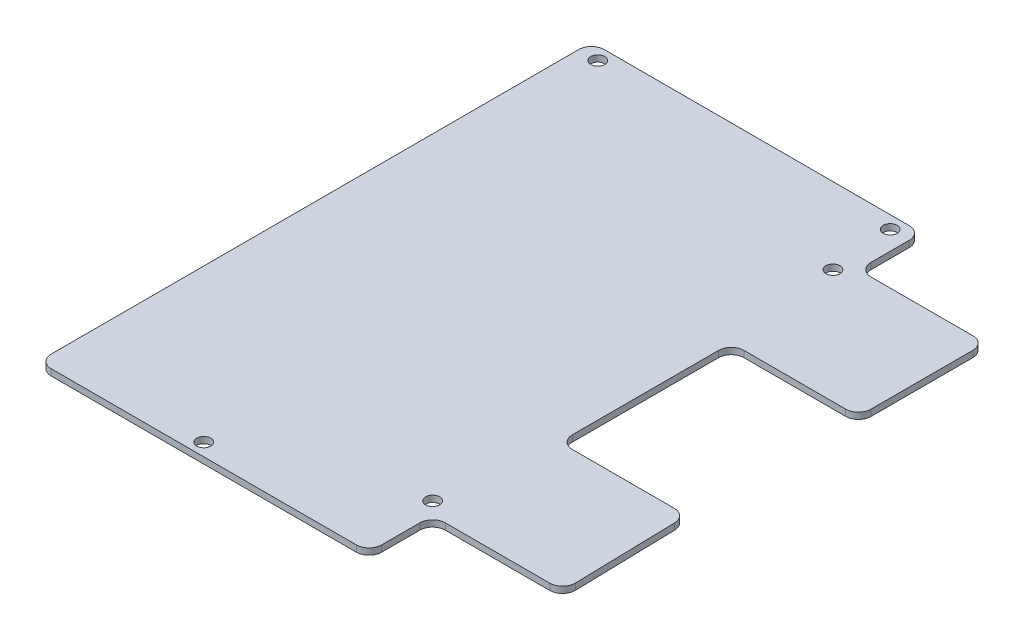
ISO-10303-21;
HEADER;
FILE_DESCRIPTION(('STEP AP214'),'2;1');
FILE_NAME('part.step','',(''),(''),'','','');
FILE_SCHEMA(('AUTOMOTIVE_DESIGN { 1 0 10303 214 1 1 1 1 }'));
ENDSEC;
DATA;
#1=APPLICATION_CONTEXT('core data for automotive mechanical design processes');
#2=APPLICATION_PROTOCOL_DEFINITION('international standard','automotive_design',2000,#1);
#3=PRODUCT_CONTEXT('',#1,'mechanical');
#4=PRODUCT('Part','Part','',(#3));
#5=PRODUCT_RELATED_PRODUCT_CATEGORY('part','',(#4));
#6=PRODUCT_DEFINITION_FORMATION('','',#4);
#7=PRODUCT_DEFINITION_CONTEXT('part definition',#1,'design');
#8=PRODUCT_DEFINITION('design','',#6,#7);
#9=PRODUCT_DEFINITION_SHAPE('','',#8);
#10=(LENGTH_UNIT() NAMED_UNIT(*) SI_UNIT(.MILLI.,.METRE.));
#11=(NAMED_UNIT(*) PLANE_ANGLE_UNIT() SI_UNIT($,.RADIAN.));
#12=(NAMED_UNIT(*) SI_UNIT($,.STERADIAN.) SOLID_ANGLE_UNIT());
#13=UNCERTAINTY_MEASURE_WITH_UNIT(LENGTH_MEASURE(1.E-05),#10,'distance_accuracy_value','');
#14=(GEOMETRIC_REPRESENTATION_CONTEXT(3) GLOBAL_UNCERTAINTY_ASSIGNED_CONTEXT((#13)) GLOBAL_UNIT_ASSIGNED_CONTEXT((#10,
#11,#12)) REPRESENTATION_CONTEXT('',''));
#15=CARTESIAN_POINT('',(0.,0.,0.));
#16=DIRECTION('',(0.,0.,1.));
#17=DIRECTION('',(1.,0.,0.));
#18=AXIS2_PLACEMENT_3D('',#15,#16,#17);
#19=CARTESIAN_POINT('',(-0.33632682595764,1.,0.));
#20=DIRECTION('',(1.,0.,0.));
#21=DIRECTION('',(0.,0.,-1.));
#22=AXIS2_PLACEMENT_3D('',#19,#20,#21);
#23=PLANE('',#22);
#24=DIRECTION('',(0.,0.,1.));
#25=VECTOR('',#24,1.);
#26=CARTESIAN_POINT('',(-0.33632682595764,1.,0.));
#27=LINE('',#26,#25);
#28=CARTESIAN_POINT('',(-0.33632682595764,1.,-85.));
#29=VERTEX_POINT('',#28);
#30=CARTESIAN_POINT('',(-0.33632682595764,1.,-2.));
#31=VERTEX_POINT('',#30);
#32=EDGE_CURVE('E222',#29,#31,#27,.T.);
#33=ORIENTED_EDGE('',*,*,#32,.F.);
#34=DIRECTION('',(0.,-1.,0.));
#35=VECTOR('',#34,1.);
#36=CARTESIAN_POINT('',(-0.33632682595764,1.,-85.));
#37=LINE('',#36,#35);
#38=CARTESIAN_POINT('',(-0.33632682595764,0.,-85.));
#39=VERTEX_POINT('',#38);
#40=EDGE_CURVE('E206',#29,#39,#37,.T.);
#41=ORIENTED_EDGE('',*,*,#40,.T.);
#42=DIRECTION('',(0.,0.,1.));
#43=VECTOR('',#42,1.);
#44=CARTESIAN_POINT('',(-0.33632682595764,0.,0.));
#45=LINE('',#44,#43);
#46=CARTESIAN_POINT('',(-0.33632682595764,0.,-2.));
#47=VERTEX_POINT('',#46);
#48=EDGE_CURVE('E219',#39,#47,#45,.T.);
#49=ORIENTED_EDGE('',*,*,#48,.T.);
#50=DIRECTION('',(0.,-1.,0.));
#51=VECTOR('',#50,1.);
#52=CARTESIAN_POINT('',(-0.33632682595764,1.,-2.));
#53=LINE('',#52,#51);
#54=EDGE_CURVE('E225',#47,#31,#53,.F.);
#55=ORIENTED_EDGE('',*,*,#54,.T.);
#56=EDGE_LOOP('',(#33,#41,#49,#55));
#57=FACE_BOUND('',#56,.T.);
#58=ADVANCED_FACE('F39',(#57),#23,.F.);
#59=CARTESIAN_POINT('',(-0.33632682595764,1.,0.));
#60=DIRECTION('',(0.,0.,-1.));
#61=DIRECTION('',(-1.,0.,0.));
#62=AXIS2_PLACEMENT_3D('',#59,#60,#61);
#63=PLANE('',#62);
#64=DIRECTION('',(1.,0.,0.));
#65=VECTOR('',#64,1.);
#66=CARTESIAN_POINT('',(-0.33632682595764,0.,0.));
#67=LINE('',#66,#65);
#68=CARTESIAN_POINT('',(1.66367317404236,0.,0.));
#69=VERTEX_POINT('',#68);
#70=CARTESIAN_POINT('',(49.6636731740423,0.,0.));
#71=VERTEX_POINT('',#70);
#72=EDGE_CURVE('E230',#69,#71,#67,.T.);
#73=ORIENTED_EDGE('',*,*,#72,.T.);
#74=DIRECTION('',(0.,-1.,0.));
#75=VECTOR('',#74,1.);
#76=CARTESIAN_POINT('',(49.6636731740424,1.,0.));
#77=LINE('',#76,#75);
#78=CARTESIAN_POINT('',(49.6636731740423,1.,0.));
#79=VERTEX_POINT('',#78);
#80=EDGE_CURVE('E398',#71,#79,#77,.F.);
#81=ORIENTED_EDGE('',*,*,#80,.T.);
#82=DIRECTION('',(1.,0.,0.));
#83=VECTOR('',#82,1.);
#84=CARTESIAN_POINT('',(-0.33632682595764,1.,0.));
#85=LINE('',#84,#83);
#86=CARTESIAN_POINT('',(1.66367317404236,1.,0.));
#87=VERTEX_POINT('',#86);
#88=EDGE_CURVE('E448',#87,#79,#85,.T.);
#89=ORIENTED_EDGE('',*,*,#88,.F.);
#90=DIRECTION('',(0.,-1.,0.));
#91=VECTOR('',#90,1.);
#92=CARTESIAN_POINT('',(1.66367317404236,1.,0.));
#93=LINE('',#92,#91);
#94=EDGE_CURVE('E394',#87,#69,#93,.T.);
#95=ORIENTED_EDGE('',*,*,#94,.T.);
#96=EDGE_LOOP('',(#73,#81,#89,#95));
#97=FACE_BOUND('',#96,.T.);
#98=ADVANCED_FACE('F547',(#97),#63,.F.);
#99=CARTESIAN_POINT('',(51.6636731740424,1.,0.));
#100=DIRECTION('',(-1.,0.,0.));
#101=DIRECTION('',(0.,0.,1.));
#102=AXIS2_PLACEMENT_3D('',#99,#100,#101);
#103=PLANE('',#102);
#104=DIRECTION('',(0.,0.,-1.));
#105=VECTOR('',#104,1.);
#106=CARTESIAN_POINT('',(51.6636731740424,0.,0.));
#107=LINE('',#106,#105);
#108=CARTESIAN_POINT('',(51.6636731740424,0.,-2.));
#109=VERTEX_POINT('',#108);
#110=CARTESIAN_POINT('',(51.6636731740424,0.,-8.00287687778543));
#111=VERTEX_POINT('',#110);
#112=EDGE_CURVE('E236',#109,#111,#107,.T.);
#113=ORIENTED_EDGE('',*,*,#112,.T.);
#114=DIRECTION('',(0.,-1.,0.));
#115=VECTOR('',#114,1.);
#116=CARTESIAN_POINT('',(51.6636731740424,1.,-8.00287687778543));
#117=LINE('',#116,#115);
#118=CARTESIAN_POINT('',(51.6636731740424,1.,-8.00287687778543));
#119=VERTEX_POINT('',#118);
#120=EDGE_CURVE('E391',#111,#119,#117,.F.);
#121=ORIENTED_EDGE('',*,*,#120,.T.);
#122=DIRECTION('',(0.,0.,-1.));
#123=VECTOR('',#122,1.);
#124=CARTESIAN_POINT('',(51.6636731740424,1.,0.));
#125=LINE('',#124,#123);
#126=CARTESIAN_POINT('',(51.6636731740424,1.,-2.));
#127=VERTEX_POINT('',#126);
#128=EDGE_CURVE('E436',#127,#119,#125,.T.);
#129=ORIENTED_EDGE('',*,*,#128,.F.);
#130=DIRECTION('',(0.,-1.,0.));
#131=VECTOR('',#130,1.);
#132=CARTESIAN_POINT('',(51.6636731740424,1.,-2.));
#133=LINE('',#132,#131);
#134=EDGE_CURVE('E387',#127,#109,#133,.T.);
#135=ORIENTED_EDGE('',*,*,#134,.T.);
#136=EDGE_LOOP('',(#113,#121,#129,#135));
#137=FACE_BOUND('',#136,.T.);
#138=ADVANCED_FACE('F424',(#137),#103,.F.);
#139=CARTESIAN_POINT('',(51.6636731740424,1.,-10.0027590485584));
#140=DIRECTION('',(-5.8916348957392E-05,0.,-0.999999998264432));
#141=DIRECTION('',(-0.999999998264432,0.,5.8916348957392E-05));
#142=AXIS2_PLACEMENT_3D('',#139,#140,#141);
#143=PLANE('',#142);
#144=DIRECTION('',(0.999999998264432,0.,-5.8916348957392E-05));
#145=VECTOR('',#144,1.);
#146=CARTESIAN_POINT('',(51.6636731740424,0.,-10.0027590485584));
#147=LINE('',#146,#145);
#148=CARTESIAN_POINT('',(53.6635553413444,0.,-10.0028768743143));
#149=VERTEX_POINT('',#148);
#150=CARTESIAN_POINT('',(70.1040441710044,0.,-10.0038454878929));
#151=VERTEX_POINT('',#150);
#152=EDGE_CURVE('E248',#149,#151,#147,.T.);
#153=ORIENTED_EDGE('',*,*,#152,.T.);
#154=DIRECTION('',(0.,-1.,0.));
#155=VECTOR('',#154,1.);
#156=CARTESIAN_POINT('',(70.1040441710044,1.,-10.0038454878929));
#157=LINE('',#156,#155);
#158=CARTESIAN_POINT('',(70.1040441710044,1.,-10.0038454878929));
#159=VERTEX_POINT('',#158);
#160=EDGE_CURVE('E384',#151,#159,#157,.F.);
#161=ORIENTED_EDGE('',*,*,#160,.T.);
#162=DIRECTION('',(0.999999998264432,0.,-5.8916348957392E-05));
#163=VECTOR('',#162,1.);
#164=CARTESIAN_POINT('',(51.6636731740424,1.,-10.0027590485584));
#165=LINE('',#164,#163);
#166=CARTESIAN_POINT('',(53.6635553413444,1.,-10.0028768743143));
#167=VERTEX_POINT('',#166);
#168=EDGE_CURVE('E434',#167,#159,#165,.T.);
#169=ORIENTED_EDGE('',*,*,#168,.F.);
#170=DIRECTION('',(0.,-1.,0.));
#171=VECTOR('',#170,1.);
#172=CARTESIAN_POINT('',(53.6635553413444,0.,-10.0028768743143));
#173=LINE('',#172,#171);
#174=EDGE_CURVE('E380',#167,#149,#173,.T.);
#175=ORIENTED_EDGE('',*,*,#174,.T.);
#176=EDGE_LOOP('',(#153,#161,#169,#175));
#177=FACE_BOUND('',#176,.T.);
#178=ADVANCED_FACE('F438',(#177),#143,.F.);
#179=CARTESIAN_POINT('',(72.1535232501436,1.,-10.0039662357177));
#180=DIRECTION('',(-0.999700013506133,0.,0.0244925089739334));
#181=DIRECTION('',(0.0244925089739334,0.,0.999700013506133));
#182=AXIS2_PLACEMENT_3D('',#179,#180,#181);
#183=PLANE('',#182);
#184=DIRECTION('',(-0.0244925089739334,0.,-0.999700013506133));
#185=VECTOR('',#184,1.);
#186=CARTESIAN_POINT('',(72.1535232501436,0.,-10.0039662357177));
#187=LINE('',#186,#185);
#188=CARTESIAN_POINT('',(72.1033263653187,0.,-12.0528305023696));
#189=VERTEX_POINT('',#188);
#190=CARTESIAN_POINT('',(71.7114678006262,0.,-28.0471499423502));
#191=VERTEX_POINT('',#190);
#192=EDGE_CURVE('E252',#189,#191,#187,.T.);
#193=ORIENTED_EDGE('',*,*,#192,.T.);
#194=DIRECTION('',(0.,-1.,0.));
#195=VECTOR('',#194,1.);
#196=CARTESIAN_POINT('',(71.7114678006262,1.,-28.0471499423502));
#197=LINE('',#196,#195);
#198=CARTESIAN_POINT('',(71.7114678006262,1.,-28.0471499423502));
#199=VERTEX_POINT('',#198);
#200=EDGE_CURVE('E377',#191,#199,#197,.F.);
#201=ORIENTED_EDGE('',*,*,#200,.T.);
#202=DIRECTION('',(-0.0244925089739334,0.,-0.999700013506133));
#203=VECTOR('',#202,1.);
#204=CARTESIAN_POINT('',(72.1535232501436,1.,-10.0039662357177));
#205=LINE('',#204,#203);
#206=CARTESIAN_POINT('',(72.1033263653187,1.,-12.0528305023696));
#207=VERTEX_POINT('',#206);
#208=EDGE_CURVE('E441',#207,#199,#205,.T.);
#209=ORIENTED_EDGE('',*,*,#208,.F.);
#210=DIRECTION('',(0.,-1.,0.));
#211=VECTOR('',#210,1.);
#212=CARTESIAN_POINT('',(72.1033263653187,1.,-12.0528305023696));
#213=LINE('',#212,#211);
#214=EDGE_CURVE('E373',#207,#189,#213,.T.);
#215=ORIENTED_EDGE('',*,*,#214,.T.);
#216=EDGE_LOOP('',(#193,#201,#209,#215));
#217=FACE_BOUND('',#216,.T.);
#218=ADVANCED_FACE('F532',(#217),#183,.F.);
#219=CARTESIAN_POINT('',(51.6636731740424,1.,-30.));
#220=DIRECTION('',(-0.000101674707981766,0.,0.999999994831127));
#221=DIRECTION('',(0.999999994831127,0.,0.000101674707981766));
#222=AXIS2_PLACEMENT_3D('',#219,#220,#221);
#223=PLANE('',#222);
#224=DIRECTION('',(-0.999999994831127,0.,-0.000101674707981766));
#225=VECTOR('',#224,1.);
#226=CARTESIAN_POINT('',(51.6636731740424,0.,-30.));
#227=LINE('',#226,#225);
#228=CARTESIAN_POINT('',(69.7122711230298,0.,-29.9981649140646));
#229=VERTEX_POINT('',#228);
#230=CARTESIAN_POINT('',(53.6634698246264,0.,-29.9997966712585));
#231=VERTEX_POINT('',#230);
#232=EDGE_CURVE('E256',#229,#231,#227,.T.);
#233=ORIENTED_EDGE('',*,*,#232,.T.);
#234=DIRECTION('',(0.,-1.,0.));
#235=VECTOR('',#234,1.);
#236=CARTESIAN_POINT('',(53.6634698246264,1.,-29.9997966712585));
#237=LINE('',#236,#235);
#238=CARTESIAN_POINT('',(53.6634698246264,1.,-29.9997966712585));
#239=VERTEX_POINT('',#238);
#240=EDGE_CURVE('E370',#231,#239,#237,.F.);
#241=ORIENTED_EDGE('',*,*,#240,.T.);
#242=DIRECTION('',(-0.999999994831127,0.,-0.000101674707981766));
#243=VECTOR('',#242,1.);
#244=CARTESIAN_POINT('',(51.6636731740424,1.,-30.));
#245=LINE('',#244,#243);
#246=CARTESIAN_POINT('',(69.7122711230298,1.,-29.9981649140646));
#247=VERTEX_POINT('',#246);
#248=EDGE_CURVE('E446',#247,#239,#245,.T.);
#249=ORIENTED_EDGE('',*,*,#248,.F.);
#250=DIRECTION('',(0.,-1.,0.));
#251=VECTOR('',#250,1.);
#252=CARTESIAN_POINT('',(69.7122711230298,1.,-29.9981649140646));
#253=LINE('',#252,#251);
#254=EDGE_CURVE('E366',#247,#229,#253,.T.);
#255=ORIENTED_EDGE('',*,*,#254,.T.);
#256=EDGE_LOOP('',(#233,#241,#249,#255));
#257=FACE_BOUND('',#256,.T.);
#258=ADVANCED_FACE('F523',(#257),#223,.F.);
#259=CARTESIAN_POINT('',(51.6636731740424,1.,-30.));
#260=DIRECTION('',(-1.,0.,0.));
#261=DIRECTION('',(0.,0.,1.));
#262=AXIS2_PLACEMENT_3D('',#259,#260,#261);
#263=PLANE('',#262);
#264=DIRECTION('',(0.,0.,-1.));
#265=VECTOR('',#264,1.);
#266=CARTESIAN_POINT('',(51.6636731740424,0.,-30.));
#267=LINE('',#266,#265);
#268=CARTESIAN_POINT('',(51.6636731740424,0.,-31.9997966609207));
#269=VERTEX_POINT('',#268);
#270=CARTESIAN_POINT('',(51.6636731740424,0.,-55.));
#271=VERTEX_POINT('',#270);
#272=EDGE_CURVE('E260',#269,#271,#267,.T.);
#273=ORIENTED_EDGE('',*,*,#272,.T.);
#274=DIRECTION('',(0.,-1.,0.));
#275=VECTOR('',#274,1.);
#276=CARTESIAN_POINT('',(51.6636731740424,1.,-55.));
#277=LINE('',#276,#275);
#278=CARTESIAN_POINT('',(51.6636731740424,1.,-55.));
#279=VERTEX_POINT('',#278);
#280=EDGE_CURVE('E363',#271,#279,#277,.F.);
#281=ORIENTED_EDGE('',*,*,#280,.T.);
#282=DIRECTION('',(0.,0.,-1.));
#283=VECTOR('',#282,1.);
#284=CARTESIAN_POINT('',(51.6636731740424,1.,-30.));
#285=LINE('',#284,#283);
#286=CARTESIAN_POINT('',(51.6636731740424,1.,-31.9997966609207));
#287=VERTEX_POINT('',#286);
#288=EDGE_CURVE('E455',#287,#279,#285,.T.);
#289=ORIENTED_EDGE('',*,*,#288,.F.);
#290=DIRECTION('',(0.,-1.,0.));
#291=VECTOR('',#290,1.);
#292=CARTESIAN_POINT('',(51.6636731740424,0.,-31.9997966609207));
#293=LINE('',#292,#291);
#294=EDGE_CURVE('E359',#287,#269,#293,.T.);
#295=ORIENTED_EDGE('',*,*,#294,.T.);
#296=EDGE_LOOP('',(#273,#281,#289,#295));
#297=FACE_BOUND('',#296,.T.);
#298=ADVANCED_FACE('F514',(#297),#263,.F.);
#299=CARTESIAN_POINT('',(51.6636731740424,1.,-57.));
#300=DIRECTION('',(0.,0.,-1.));
#301=DIRECTION('',(-1.,0.,0.));
#302=AXIS2_PLACEMENT_3D('',#299,#300,#301);
#303=PLANE('',#302);
#304=DIRECTION('',(1.,0.,0.));
#305=VECTOR('',#304,1.);
#306=CARTESIAN_POINT('',(51.6636731740424,0.,-57.));
#307=LINE('',#306,#305);
#308=CARTESIAN_POINT('',(53.6636731740424,0.,-57.));
#309=VERTEX_POINT('',#308);
#310=CARTESIAN_POINT('',(69.6636731740424,0.,-57.));
#311=VERTEX_POINT('',#310);
#312=EDGE_CURVE('E264',#309,#311,#307,.T.);
#313=ORIENTED_EDGE('',*,*,#312,.T.);
#314=DIRECTION('',(0.,-1.,0.));
#315=VECTOR('',#314,1.);
#316=CARTESIAN_POINT('',(69.6636731740424,1.,-57.));
#317=LINE('',#316,#315);
#318=CARTESIAN_POINT('',(69.6636731740424,1.,-57.));
#319=VERTEX_POINT('',#318);
#320=EDGE_CURVE('E356',#311,#319,#317,.F.);
#321=ORIENTED_EDGE('',*,*,#320,.T.);
#322=DIRECTION('',(1.,0.,0.));
#323=VECTOR('',#322,1.);
#324=CARTESIAN_POINT('',(51.6636731740424,1.,-57.));
#325=LINE('',#324,#323);
#326=CARTESIAN_POINT('',(53.6636731740424,1.,-57.));
#327=VERTEX_POINT('',#326);
#328=EDGE_CURVE('E459',#327,#319,#325,.T.);
#329=ORIENTED_EDGE('',*,*,#328,.F.);
#330=DIRECTION('',(0.,-1.,0.));
#331=VECTOR('',#330,1.);
#332=CARTESIAN_POINT('',(53.6636731740424,0.,-57.));
#333=LINE('',#332,#331);
#334=EDGE_CURVE('E352',#327,#309,#333,.T.);
#335=ORIENTED_EDGE('',*,*,#334,.T.);
#336=EDGE_LOOP('',(#313,#321,#329,#335));
#337=FACE_BOUND('',#336,.T.);
#338=ADVANCED_FACE('F505',(#337),#303,.F.);
#339=CARTESIAN_POINT('',(71.6636731740424,1.,-77.));
#340=DIRECTION('',(-1.,0.,0.));
#341=DIRECTION('',(0.,0.,1.));
#342=AXIS2_PLACEMENT_3D('',#339,#340,#341);
#343=PLANE('',#342);
#344=DIRECTION('',(0.,0.,-1.));
#345=VECTOR('',#344,1.);
#346=CARTESIAN_POINT('',(71.6636731740424,0.,-77.));
#347=LINE('',#346,#345);
#348=CARTESIAN_POINT('',(71.6636731740424,0.,-59.));
#349=VERTEX_POINT('',#348);
#350=CARTESIAN_POINT('',(71.6636731740424,0.,-75.));
#351=VERTEX_POINT('',#350);
#352=EDGE_CURVE('E268',#349,#351,#347,.T.);
#353=ORIENTED_EDGE('',*,*,#352,.T.);
#354=DIRECTION('',(0.,-1.,0.));
#355=VECTOR('',#354,1.);
#356=CARTESIAN_POINT('',(71.6636731740424,1.,-75.));
#357=LINE('',#356,#355);
#358=CARTESIAN_POINT('',(71.6636731740424,1.,-75.));
#359=VERTEX_POINT('',#358);
#360=EDGE_CURVE('E349',#351,#359,#357,.F.);
#361=ORIENTED_EDGE('',*,*,#360,.T.);
#362=DIRECTION('',(0.,0.,-1.));
#363=VECTOR('',#362,1.);
#364=CARTESIAN_POINT('',(71.6636731740424,1.,-77.));
#365=LINE('',#364,#363);
#366=CARTESIAN_POINT('',(71.6636731740424,1.,-59.));
#367=VERTEX_POINT('',#366);
#368=EDGE_CURVE('E463',#367,#359,#365,.T.);
#369=ORIENTED_EDGE('',*,*,#368,.F.);
#370=DIRECTION('',(0.,-1.,0.));
#371=VECTOR('',#370,1.);
#372=CARTESIAN_POINT('',(71.6636731740424,1.,-59.));
#373=LINE('',#372,#371);
#374=EDGE_CURVE('E345',#367,#349,#373,.T.);
#375=ORIENTED_EDGE('',*,*,#374,.T.);
#376=EDGE_LOOP('',(#353,#361,#369,#375));
#377=FACE_BOUND('',#376,.T.);
#378=ADVANCED_FACE('F496',(#377),#343,.F.);
#379=CARTESIAN_POINT('',(51.6636731740424,1.,-77.));
#380=DIRECTION('',(0.,0.,1.));
#381=DIRECTION('',(1.,0.,0.));
#382=AXIS2_PLACEMENT_3D('',#379,#380,#381);
#383=PLANE('',#382);
#384=DIRECTION('',(-1.,0.,0.));
#385=VECTOR('',#384,1.);
#386=CARTESIAN_POINT('',(51.6636731740424,0.,-77.));
#387=LINE('',#386,#385);
#388=CARTESIAN_POINT('',(69.6636731740424,0.,-77.));
#389=VERTEX_POINT('',#388);
#390=CARTESIAN_POINT('',(53.6636731740424,0.,-77.));
#391=VERTEX_POINT('',#390);
#392=EDGE_CURVE('E272',#389,#391,#387,.T.);
#393=ORIENTED_EDGE('',*,*,#392,.T.);
#394=DIRECTION('',(0.,-1.,0.));
#395=VECTOR('',#394,1.);
#396=CARTESIAN_POINT('',(53.6636731740424,1.,-77.));
#397=LINE('',#396,#395);
#398=CARTESIAN_POINT('',(53.6636731740424,1.,-77.));
#399=VERTEX_POINT('',#398);
#400=EDGE_CURVE('E342',#391,#399,#397,.F.);
#401=ORIENTED_EDGE('',*,*,#400,.T.);
#402=DIRECTION('',(-1.,0.,0.));
#403=VECTOR('',#402,1.);
#404=CARTESIAN_POINT('',(51.6636731740424,1.,-77.));
#405=LINE('',#404,#403);
#406=CARTESIAN_POINT('',(69.6636731740424,1.,-77.));
#407=VERTEX_POINT('',#406);
#408=EDGE_CURVE('E467',#407,#399,#405,.T.);
#409=ORIENTED_EDGE('',*,*,#408,.F.);
#410=DIRECTION('',(0.,-1.,0.));
#411=VECTOR('',#410,1.);
#412=CARTESIAN_POINT('',(69.6636731740424,1.,-77.));
#413=LINE('',#412,#411);
#414=EDGE_CURVE('E338',#407,#389,#413,.T.);
#415=ORIENTED_EDGE('',*,*,#414,.T.);
#416=EDGE_LOOP('',(#393,#401,#409,#415));
#417=FACE_BOUND('',#416,.T.);
#418=ADVANCED_FACE('F487',(#417),#383,.F.);
#419=CARTESIAN_POINT('',(51.6636731740424,1.,-77.));
#420=DIRECTION('',(-1.,0.,0.));
#421=DIRECTION('',(0.,0.,1.));
#422=AXIS2_PLACEMENT_3D('',#419,#420,#421);
#423=PLANE('',#422);
#424=DIRECTION('',(0.,0.,-1.));
#425=VECTOR('',#424,1.);
#426=CARTESIAN_POINT('',(51.6636731740424,0.,-77.));
#427=LINE('',#426,#425);
#428=CARTESIAN_POINT('',(51.6636731740424,0.,-79.));
#429=VERTEX_POINT('',#428);
#430=CARTESIAN_POINT('',(51.6636731740424,0.,-85.));
#431=VERTEX_POINT('',#430);
#432=EDGE_CURVE('E276',#429,#431,#427,.T.);
#433=ORIENTED_EDGE('',*,*,#432,.T.);
#434=DIRECTION('',(0.,-1.,0.));
#435=VECTOR('',#434,1.);
#436=CARTESIAN_POINT('',(51.6636731740424,1.,-85.));
#437=LINE('',#436,#435);
#438=CARTESIAN_POINT('',(51.6636731740424,1.,-85.));
#439=VERTEX_POINT('',#438);
#440=EDGE_CURVE('E55',#431,#439,#437,.F.);
#441=ORIENTED_EDGE('',*,*,#440,.T.);
#442=DIRECTION('',(0.,0.,-1.));
#443=VECTOR('',#442,1.);
#444=CARTESIAN_POINT('',(51.6636731740424,1.,-77.));
#445=LINE('',#444,#443);
#446=CARTESIAN_POINT('',(51.6636731740424,1.,-79.));
#447=VERTEX_POINT('',#446);
#448=EDGE_CURVE('E469',#447,#439,#445,.T.);
#449=ORIENTED_EDGE('',*,*,#448,.F.);
#450=DIRECTION('',(0.,-1.,0.));
#451=VECTOR('',#450,1.);
#452=CARTESIAN_POINT('',(51.6636731740424,0.,-79.));
#453=LINE('',#452,#451);
#454=EDGE_CURVE('E332',#447,#429,#453,.T.);
#455=ORIENTED_EDGE('',*,*,#454,.T.);
#456=EDGE_LOOP('',(#433,#441,#449,#455));
#457=FACE_BOUND('',#456,.T.);
#458=ADVANCED_FACE('F480',(#457),#423,.F.);
#459=CARTESIAN_POINT('',(-0.33632682595764,1.,-87.));
#460=DIRECTION('',(0.,0.,1.));
#461=DIRECTION('',(1.,0.,0.));
#462=AXIS2_PLACEMENT_3D('',#459,#460,#461);
#463=PLANE('',#462);
#464=DIRECTION('',(-1.,0.,0.));
#465=VECTOR('',#464,1.);
#466=CARTESIAN_POINT('',(-0.33632682595764,0.,-87.));
#467=LINE('',#466,#465);
#468=CARTESIAN_POINT('',(49.6636731740423,0.,-87.));
#469=VERTEX_POINT('',#468);
#470=CARTESIAN_POINT('',(1.66367317404236,0.,-87.));
#471=VERTEX_POINT('',#470);
#472=EDGE_CURVE('E279',#469,#471,#467,.T.);
#473=ORIENTED_EDGE('',*,*,#472,.T.);
#474=DIRECTION('',(0.,-1.,0.));
#475=VECTOR('',#474,1.);
#476=CARTESIAN_POINT('',(1.66367317404236,1.,-87.));
#477=LINE('',#476,#475);
#478=CARTESIAN_POINT('',(1.66367317404236,1.,-87.));
#479=VERTEX_POINT('',#478);
#480=EDGE_CURVE('E207',#471,#479,#477,.F.);
#481=ORIENTED_EDGE('',*,*,#480,.T.);
#482=DIRECTION('',(-1.,0.,0.));
#483=VECTOR('',#482,1.);
#484=CARTESIAN_POINT('',(-0.33632682595764,1.,-87.));
#485=LINE('',#484,#483);
#486=CARTESIAN_POINT('',(49.6636731740423,1.,-87.));
#487=VERTEX_POINT('',#486);
#488=EDGE_CURVE('E242',#487,#479,#485,.T.);
#489=ORIENTED_EDGE('',*,*,#488,.F.);
#490=DIRECTION('',(0.,-1.,0.));
#491=VECTOR('',#490,1.);
#492=CARTESIAN_POINT('',(49.6636731740424,1.,-87.));
#493=LINE('',#492,#491);
#494=EDGE_CURVE('E213',#487,#469,#493,.T.);
#495=ORIENTED_EDGE('',*,*,#494,.T.);
#496=EDGE_LOOP('',(#473,#481,#489,#495));
#497=FACE_BOUND('',#496,.T.);
#498=ADVANCED_FACE('F476',(#497),#463,.F.);
#499=CARTESIAN_POINT('',(0.,1.,0.));
#500=DIRECTION('',(0.,-1.,0.));
#501=DIRECTION('',(0.,0.,-1.));
#502=AXIS2_PLACEMENT_3D('',#499,#500,#501);
#503=PLANE('',#502);
#504=CARTESIAN_POINT('',(2.66367317404236,1.,-85.));
#505=DIRECTION('',(0.,-1.,0.));
#506=DIRECTION('',(0.,0.,-1.));
#507=AXIS2_PLACEMENT_3D('',#504,#505,#506);
#508=CIRCLE('',#507,1.10000000000001);
#509=CARTESIAN_POINT('',(2.66367317404236,1.,-86.1));
#510=VERTEX_POINT('',#509);
#511=EDGE_CURVE('E231',#510,#510,#508,.T.);
#512=ORIENTED_EDGE('',*,*,#511,.T.);
#513=EDGE_LOOP('',(#512));
#514=FACE_BOUND('',#513,.T.);
#515=CARTESIAN_POINT('',(49.6636731740424,1.,-75.));
#516=DIRECTION('',(0.,-1.,0.));
#517=DIRECTION('',(0.,0.,-1.));
#518=AXIS2_PLACEMENT_3D('',#515,#516,#517);
#519=CIRCLE('',#518,1.10000000000001);
#520=CARTESIAN_POINT('',(49.6636731740424,1.,-76.1));
#521=VERTEX_POINT('',#520);
#522=EDGE_CURVE('E239',#521,#521,#519,.T.);
#523=ORIENTED_EDGE('',*,*,#522,.T.);
#524=EDGE_LOOP('',(#523));
#525=FACE_BOUND('',#524,.T.);
#526=CARTESIAN_POINT('',(49.6636731740424,1.,-12.0026412193315));
#527=DIRECTION('',(0.,-1.,0.));
#528=DIRECTION('',(0.,0.,-1.));
#529=AXIS2_PLACEMENT_3D('',#526,#527,#528);
#530=CIRCLE('',#529,1.1);
#531=CARTESIAN_POINT('',(49.6636731740424,1.,-13.1026412193315));
#532=VERTEX_POINT('',#531);
#533=EDGE_CURVE('E621',#532,#532,#530,.T.);
#534=ORIENTED_EDGE('',*,*,#533,.T.);
#535=EDGE_LOOP('',(#534));
#536=FACE_BOUND('',#535,.T.);
#537=CARTESIAN_POINT('',(23.6636731740424,1.,-2.));
#538=DIRECTION('',(0.,-1.,0.));
#539=DIRECTION('',(0.,0.,-1.));
#540=AXIS2_PLACEMENT_3D('',#537,#538,#539);
#541=CIRCLE('',#540,1.1);
#542=CARTESIAN_POINT('',(23.6636731740424,1.,-3.1));
#543=VERTEX_POINT('',#542);
#544=EDGE_CURVE('E625',#543,#543,#541,.T.);
#545=ORIENTED_EDGE('',*,*,#544,.T.);
#546=EDGE_LOOP('',(#545));
#547=FACE_BOUND('',#546,.T.);
#548=CARTESIAN_POINT('',(48.6636731740424,1.,-85.));
#549=DIRECTION('',(0.,-1.,0.));
#550=DIRECTION('',(0.,0.,-1.));
#551=AXIS2_PLACEMENT_3D('',#548,#549,#550);
#552=CIRCLE('',#551,1.10000000000001);
#553=CARTESIAN_POINT('',(48.6636731740424,1.,-86.1));
#554=VERTEX_POINT('',#553);
#555=EDGE_CURVE('E629',#554,#554,#552,.T.);
#556=ORIENTED_EDGE('',*,*,#555,.T.);
#557=EDGE_LOOP('',(#556));
#558=FACE_BOUND('',#557,.T.);
#559=ORIENTED_EDGE('',*,*,#488,.T.);
#560=CARTESIAN_POINT('',(1.66367317404236,1.,-85.));
#561=DIRECTION('',(0.,-1.,0.));
#562=DIRECTION('',(0.,0.,-1.));
#563=AXIS2_PLACEMENT_3D('',#560,#561,#562);
#564=CIRCLE('',#563,2.);
#565=EDGE_CURVE('E329',#479,#29,#564,.F.);
#566=ORIENTED_EDGE('',*,*,#565,.T.);
#567=ORIENTED_EDGE('',*,*,#32,.T.);
#568=CARTESIAN_POINT('',(1.66367317404236,1.,-2.));
#569=DIRECTION('',(0.,-1.,0.));
#570=DIRECTION('',(0.,0.,-1.));
#571=AXIS2_PLACEMENT_3D('',#568,#569,#570);
#572=CIRCLE('',#571,2.);
#573=EDGE_CURVE('E308',#31,#87,#572,.F.);
#574=ORIENTED_EDGE('',*,*,#573,.T.);
#575=ORIENTED_EDGE('',*,*,#88,.T.);
#576=CARTESIAN_POINT('',(49.6636731740424,1.,-2.));
#577=DIRECTION('',(0.,-1.,0.));
#578=DIRECTION('',(0.,0.,-1.));
#579=AXIS2_PLACEMENT_3D('',#576,#577,#578);
#580=CIRCLE('',#579,2.);
#581=EDGE_CURVE('E311',#79,#127,#580,.F.);
#582=ORIENTED_EDGE('',*,*,#581,.T.);
#583=ORIENTED_EDGE('',*,*,#128,.T.);
#584=CARTESIAN_POINT('',(53.6636731740424,1.,-8.00287687778543));
#585=DIRECTION('',(0.,-1.,0.));
#586=DIRECTION('',(0.,0.,-1.));
#587=AXIS2_PLACEMENT_3D('',#584,#585,#586);
#588=CIRCLE('',#587,2.);
#589=EDGE_CURVE('E11',#119,#167,#588,.T.);
#590=ORIENTED_EDGE('',*,*,#589,.T.);
#591=ORIENTED_EDGE('',*,*,#168,.T.);
#592=CARTESIAN_POINT('',(70.1039263383065,1.,-12.0038454844218));
#593=DIRECTION('',(0.,-1.,0.));
#594=DIRECTION('',(0.,0.,-1.));
#595=AXIS2_PLACEMENT_3D('',#592,#593,#594);
#596=CIRCLE('',#595,2.);
#597=EDGE_CURVE('E314',#159,#207,#596,.F.);
#598=ORIENTED_EDGE('',*,*,#597,.T.);
#599=ORIENTED_EDGE('',*,*,#208,.T.);
#600=CARTESIAN_POINT('',(69.7120677736139,1.,-27.9981649244023));
#601=DIRECTION('',(0.,-1.,0.));
#602=DIRECTION('',(0.,0.,-1.));
#603=AXIS2_PLACEMENT_3D('',#600,#601,#602);
#604=CIRCLE('',#603,2.);
#605=EDGE_CURVE('E317',#199,#247,#604,.F.);
#606=ORIENTED_EDGE('',*,*,#605,.T.);
#607=ORIENTED_EDGE('',*,*,#248,.T.);
#608=CARTESIAN_POINT('',(53.6636731740424,1.,-31.9997966609207));
#609=DIRECTION('',(0.,-1.,0.));
#610=DIRECTION('',(0.,0.,-1.));
#611=AXIS2_PLACEMENT_3D('',#608,#609,#610);
#612=CIRCLE('',#611,2.);
#613=EDGE_CURVE('E415',#239,#287,#612,.T.);
#614=ORIENTED_EDGE('',*,*,#613,.T.);
#615=ORIENTED_EDGE('',*,*,#288,.T.);
#616=CARTESIAN_POINT('',(53.6636731740424,1.,-55.));
#617=DIRECTION('',(0.,-1.,0.));
#618=DIRECTION('',(0.,0.,-1.));
#619=AXIS2_PLACEMENT_3D('',#616,#617,#618);
#620=CIRCLE('',#619,2.);
#621=EDGE_CURVE('E409',#279,#327,#620,.T.);
#622=ORIENTED_EDGE('',*,*,#621,.T.);
#623=ORIENTED_EDGE('',*,*,#328,.T.);
#624=CARTESIAN_POINT('',(69.6636731740424,1.,-59.));
#625=DIRECTION('',(0.,-1.,0.));
#626=DIRECTION('',(0.,0.,-1.));
#627=AXIS2_PLACEMENT_3D('',#624,#625,#626);
#628=CIRCLE('',#627,2.);
#629=EDGE_CURVE('E320',#319,#367,#628,.F.);
#630=ORIENTED_EDGE('',*,*,#629,.T.);
#631=ORIENTED_EDGE('',*,*,#368,.T.);
#632=CARTESIAN_POINT('',(69.6636731740424,1.,-75.));
#633=DIRECTION('',(0.,-1.,0.));
#634=DIRECTION('',(0.,0.,-1.));
#635=AXIS2_PLACEMENT_3D('',#632,#633,#634);
#636=CIRCLE('',#635,2.);
#637=EDGE_CURVE('E323',#359,#407,#636,.F.);
#638=ORIENTED_EDGE('',*,*,#637,.T.);
#639=ORIENTED_EDGE('',*,*,#408,.T.);
#640=CARTESIAN_POINT('',(53.6636731740424,1.,-79.));
#641=DIRECTION('',(0.,-1.,0.));
#642=DIRECTION('',(0.,0.,-1.));
#643=AXIS2_PLACEMENT_3D('',#640,#641,#642);
#644=CIRCLE('',#643,2.);
#645=EDGE_CURVE('E62',#399,#447,#644,.T.);
#646=ORIENTED_EDGE('',*,*,#645,.T.);
#647=ORIENTED_EDGE('',*,*,#448,.T.);
#648=CARTESIAN_POINT('',(49.6636731740424,1.,-85.));
#649=DIRECTION('',(0.,-1.,0.));
#650=DIRECTION('',(0.,0.,-1.));
#651=AXIS2_PLACEMENT_3D('',#648,#649,#650);
#652=CIRCLE('',#651,2.);
#653=EDGE_CURVE('E326',#439,#487,#652,.F.);
#654=ORIENTED_EDGE('',*,*,#653,.T.);
#655=EDGE_LOOP('',(#559,#566,#567,#574,#575,#582,#583,#590,#591,#598,#599,#606,#607,#614,#615,
#622,#623,#630,#631,#638,#639,#646,#647,#654));
#656=FACE_BOUND('',#655,.T.);
#657=ADVANCED_FACE('F433',(#514,#525,#536,#547,#558,#656),#503,.F.);
#658=CARTESIAN_POINT('',(0.,0.,0.));
#659=DIRECTION('',(0.,-1.,0.));
#660=DIRECTION('',(0.,0.,-1.));
#661=AXIS2_PLACEMENT_3D('',#658,#659,#660);
#662=PLANE('',#661);
#663=CARTESIAN_POINT('',(2.66367317404236,0.,-85.));
#664=DIRECTION('',(0.,-1.,0.));
#665=DIRECTION('',(0.,0.,-1.));
#666=AXIS2_PLACEMENT_3D('',#663,#664,#665);
#667=CIRCLE('',#666,1.10000000000001);
#668=CARTESIAN_POINT('',(2.66367317404236,0.,-86.1));
#669=VERTEX_POINT('',#668);
#670=EDGE_CURVE('E633',#669,#669,#667,.T.);
#671=ORIENTED_EDGE('',*,*,#670,.F.);
#672=EDGE_LOOP('',(#671));
#673=FACE_BOUND('',#672,.T.);
#674=CARTESIAN_POINT('',(49.6636731740424,0.,-75.));
#675=DIRECTION('',(0.,-1.,0.));
#676=DIRECTION('',(0.,0.,-1.));
#677=AXIS2_PLACEMENT_3D('',#674,#675,#676);
#678=CIRCLE('',#677,1.10000000000001);
#679=CARTESIAN_POINT('',(49.6636731740424,0.,-76.1));
#680=VERTEX_POINT('',#679);
#681=EDGE_CURVE('E643',#680,#680,#678,.T.);
#682=ORIENTED_EDGE('',*,*,#681,.F.);
#683=EDGE_LOOP('',(#682));
#684=FACE_BOUND('',#683,.T.);
#685=CARTESIAN_POINT('',(49.6636731740424,0.,-12.0026412193315));
#686=DIRECTION('',(0.,-1.,0.));
#687=DIRECTION('',(0.,0.,-1.));
#688=AXIS2_PLACEMENT_3D('',#685,#686,#687);
#689=CIRCLE('',#688,1.1);
#690=CARTESIAN_POINT('',(49.6636731740424,0.,-13.1026412193315));
#691=VERTEX_POINT('',#690);
#692=EDGE_CURVE('E639',#691,#691,#689,.T.);
#693=ORIENTED_EDGE('',*,*,#692,.F.);
#694=EDGE_LOOP('',(#693));
#695=FACE_BOUND('',#694,.T.);
#696=CARTESIAN_POINT('',(23.6636731740424,0.,-2.));
#697=DIRECTION('',(0.,-1.,0.));
#698=DIRECTION('',(0.,0.,-1.));
#699=AXIS2_PLACEMENT_3D('',#696,#697,#698);
#700=CIRCLE('',#699,1.1);
#701=CARTESIAN_POINT('',(23.6636731740424,0.,-3.1));
#702=VERTEX_POINT('',#701);
#703=EDGE_CURVE('E634',#702,#702,#700,.T.);
#704=ORIENTED_EDGE('',*,*,#703,.F.);
#705=EDGE_LOOP('',(#704));
#706=FACE_BOUND('',#705,.T.);
#707=CARTESIAN_POINT('',(48.6636731740424,0.,-85.));
#708=DIRECTION('',(0.,-1.,0.));
#709=DIRECTION('',(0.,0.,-1.));
#710=AXIS2_PLACEMENT_3D('',#707,#708,#709);
#711=CIRCLE('',#710,1.10000000000001);
#712=CARTESIAN_POINT('',(48.6636731740424,0.,-86.1));
#713=VERTEX_POINT('',#712);
#714=EDGE_CURVE('E638',#713,#713,#711,.T.);
#715=ORIENTED_EDGE('',*,*,#714,.F.);
#716=EDGE_LOOP('',(#715));
#717=FACE_BOUND('',#716,.T.);
#718=ORIENTED_EDGE('',*,*,#48,.F.);
#719=CARTESIAN_POINT('',(1.66367317404236,0.,-85.));
#720=DIRECTION('',(0.,-1.,0.));
#721=DIRECTION('',(0.,0.,-1.));
#722=AXIS2_PLACEMENT_3D('',#719,#720,#721);
#723=CIRCLE('',#722,2.);
#724=EDGE_CURVE('E202',#39,#471,#723,.T.);
#725=ORIENTED_EDGE('',*,*,#724,.T.);
#726=ORIENTED_EDGE('',*,*,#472,.F.);
#727=CARTESIAN_POINT('',(49.6636731740424,0.,-85.));
#728=DIRECTION('',(0.,-1.,0.));
#729=DIRECTION('',(0.,0.,-1.));
#730=AXIS2_PLACEMENT_3D('',#727,#728,#729);
#731=CIRCLE('',#730,2.);
#732=EDGE_CURVE('E214',#469,#431,#731,.T.);
#733=ORIENTED_EDGE('',*,*,#732,.T.);
#734=ORIENTED_EDGE('',*,*,#432,.F.);
#735=CARTESIAN_POINT('',(53.6636731740424,0.,-79.));
#736=DIRECTION('',(0.,-1.,0.));
#737=DIRECTION('',(0.,0.,-1.));
#738=AXIS2_PLACEMENT_3D('',#735,#736,#737);
#739=CIRCLE('',#738,2.);
#740=EDGE_CURVE('E401',#429,#391,#739,.F.);
#741=ORIENTED_EDGE('',*,*,#740,.T.);
#742=ORIENTED_EDGE('',*,*,#392,.F.);
#743=CARTESIAN_POINT('',(69.6636731740424,0.,-75.));
#744=DIRECTION('',(0.,-1.,0.));
#745=DIRECTION('',(0.,0.,-1.));
#746=AXIS2_PLACEMENT_3D('',#743,#744,#745);
#747=CIRCLE('',#746,2.);
#748=EDGE_CURVE('E298',#389,#351,#747,.T.);
#749=ORIENTED_EDGE('',*,*,#748,.T.);
#750=ORIENTED_EDGE('',*,*,#352,.F.);
#751=CARTESIAN_POINT('',(69.6636731740424,0.,-59.));
#752=DIRECTION('',(0.,-1.,0.));
#753=DIRECTION('',(0.,0.,-1.));
#754=AXIS2_PLACEMENT_3D('',#751,#752,#753);
#755=CIRCLE('',#754,2.);
#756=EDGE_CURVE('E295',#349,#311,#755,.T.);
#757=ORIENTED_EDGE('',*,*,#756,.T.);
#758=ORIENTED_EDGE('',*,*,#312,.F.);
#759=CARTESIAN_POINT('',(53.6636731740424,0.,-55.));
#760=DIRECTION('',(0.,-1.,0.));
#761=DIRECTION('',(0.,0.,-1.));
#762=AXIS2_PLACEMENT_3D('',#759,#760,#761);
#763=CIRCLE('',#762,2.);
#764=EDGE_CURVE('E406',#309,#271,#763,.F.);
#765=ORIENTED_EDGE('',*,*,#764,.T.);
#766=ORIENTED_EDGE('',*,*,#272,.F.);
#767=CARTESIAN_POINT('',(53.6636731740424,0.,-31.9997966609207));
#768=DIRECTION('',(0.,-1.,0.));
#769=DIRECTION('',(0.,0.,-1.));
#770=AXIS2_PLACEMENT_3D('',#767,#768,#769);
#771=CIRCLE('',#770,2.);
#772=EDGE_CURVE('E412',#269,#231,#771,.F.);
#773=ORIENTED_EDGE('',*,*,#772,.T.);
#774=ORIENTED_EDGE('',*,*,#232,.F.);
#775=CARTESIAN_POINT('',(69.7120677736139,0.,-27.9981649244023));
#776=DIRECTION('',(0.,-1.,0.));
#777=DIRECTION('',(0.,0.,-1.));
#778=AXIS2_PLACEMENT_3D('',#775,#776,#777);
#779=CIRCLE('',#778,2.);
#780=EDGE_CURVE('E292',#229,#191,#779,.T.);
#781=ORIENTED_EDGE('',*,*,#780,.T.);
#782=ORIENTED_EDGE('',*,*,#192,.F.);
#783=CARTESIAN_POINT('',(70.1039263383065,0.,-12.0038454844218));
#784=DIRECTION('',(0.,-1.,0.));
#785=DIRECTION('',(0.,0.,-1.));
#786=AXIS2_PLACEMENT_3D('',#783,#784,#785);
#787=CIRCLE('',#786,2.);
#788=EDGE_CURVE('E289',#189,#151,#787,.T.);
#789=ORIENTED_EDGE('',*,*,#788,.T.);
#790=ORIENTED_EDGE('',*,*,#152,.F.);
#791=CARTESIAN_POINT('',(53.6636731740424,0.,-8.00287687778543));
#792=DIRECTION('',(0.,-1.,0.));
#793=DIRECTION('',(0.,0.,-1.));
#794=AXIS2_PLACEMENT_3D('',#791,#792,#793);
#795=CIRCLE('',#794,2.);
#796=EDGE_CURVE('E48',#149,#111,#795,.F.);
#797=ORIENTED_EDGE('',*,*,#796,.T.);
#798=ORIENTED_EDGE('',*,*,#112,.F.);
#799=CARTESIAN_POINT('',(49.6636731740424,0.,-2.));
#800=DIRECTION('',(0.,-1.,0.));
#801=DIRECTION('',(0.,0.,-1.));
#802=AXIS2_PLACEMENT_3D('',#799,#800,#801);
#803=CIRCLE('',#802,2.);
#804=EDGE_CURVE('E286',#109,#71,#803,.T.);
#805=ORIENTED_EDGE('',*,*,#804,.T.);
#806=ORIENTED_EDGE('',*,*,#72,.F.);
#807=CARTESIAN_POINT('',(1.66367317404236,0.,-2.));
#808=DIRECTION('',(0.,-1.,0.));
#809=DIRECTION('',(0.,0.,-1.));
#810=AXIS2_PLACEMENT_3D('',#807,#808,#809);
#811=CIRCLE('',#810,2.);
#812=EDGE_CURVE('E224',#69,#47,#811,.T.);
#813=ORIENTED_EDGE('',*,*,#812,.T.);
#814=EDGE_LOOP('',(#718,#725,#726,#733,#734,#741,#742,#749,#750,#757,#758,#765,#766,#773,#774,
#781,#782,#789,#790,#797,#798,#805,#806,#813));
#815=FACE_BOUND('',#814,.T.);
#816=ADVANCED_FACE('F227',(#673,#684,#695,#706,#717,#815),#662,.T.);
#817=CARTESIAN_POINT('',(48.6636731740424,4.,-85.));
#818=DIRECTION('',(0.,-1.,0.));
#819=DIRECTION('',(0.,0.,-1.));
#820=AXIS2_PLACEMENT_3D('',#817,#818,#819);
#821=CYLINDRICAL_SURFACE('',#820,1.10000000000001);
#822=ORIENTED_EDGE('',*,*,#714,.T.);
#823=EDGE_LOOP('',(#822));
#824=FACE_BOUND('',#823,.T.);
#825=ORIENTED_EDGE('',*,*,#555,.F.);
#826=EDGE_LOOP('',(#825));
#827=FACE_BOUND('',#826,.T.);
#828=ADVANCED_FACE('F658',(#824,#827),#821,.F.);
#829=CARTESIAN_POINT('',(23.6636731740424,4.,-2.));
#830=DIRECTION('',(0.,-1.,0.));
#831=DIRECTION('',(0.,0.,-1.));
#832=AXIS2_PLACEMENT_3D('',#829,#830,#831);
#833=CYLINDRICAL_SURFACE('',#832,1.1);
#834=ORIENTED_EDGE('',*,*,#703,.T.);
#835=EDGE_LOOP('',(#834));
#836=FACE_BOUND('',#835,.T.);
#837=ORIENTED_EDGE('',*,*,#544,.F.);
#838=EDGE_LOOP('',(#837));
#839=FACE_BOUND('',#838,.T.);
#840=ADVANCED_FACE('F670',(#836,#839),#833,.F.);
#841=CARTESIAN_POINT('',(49.6636731740424,4.,-12.0026412193315));
#842=DIRECTION('',(0.,-1.,0.));
#843=DIRECTION('',(0.,0.,-1.));
#844=AXIS2_PLACEMENT_3D('',#841,#842,#843);
#845=CYLINDRICAL_SURFACE('',#844,1.1);
#846=ORIENTED_EDGE('',*,*,#692,.T.);
#847=EDGE_LOOP('',(#846));
#848=FACE_BOUND('',#847,.T.);
#849=ORIENTED_EDGE('',*,*,#533,.F.);
#850=EDGE_LOOP('',(#849));
#851=FACE_BOUND('',#850,.T.);
#852=ADVANCED_FACE('F802',(#848,#851),#845,.F.);
#853=CARTESIAN_POINT('',(49.6636731740424,4.,-75.));
#854=DIRECTION('',(0.,-1.,0.));
#855=DIRECTION('',(0.,0.,-1.));
#856=AXIS2_PLACEMENT_3D('',#853,#854,#855);
#857=CYLINDRICAL_SURFACE('',#856,1.10000000000001);
#858=ORIENTED_EDGE('',*,*,#681,.T.);
#859=EDGE_LOOP('',(#858));
#860=FACE_BOUND('',#859,.T.);
#861=ORIENTED_EDGE('',*,*,#522,.F.);
#862=EDGE_LOOP('',(#861));
#863=FACE_BOUND('',#862,.T.);
#864=ADVANCED_FACE('F796',(#860,#863),#857,.F.);
#865=CARTESIAN_POINT('',(2.66367317404236,4.,-85.));
#866=DIRECTION('',(0.,-1.,0.));
#867=DIRECTION('',(0.,0.,-1.));
#868=AXIS2_PLACEMENT_3D('',#865,#866,#867);
#869=CYLINDRICAL_SURFACE('',#868,1.10000000000001);
#870=ORIENTED_EDGE('',*,*,#670,.T.);
#871=EDGE_LOOP('',(#870));
#872=FACE_BOUND('',#871,.T.);
#873=ORIENTED_EDGE('',*,*,#511,.F.);
#874=EDGE_LOOP('',(#873));
#875=FACE_BOUND('',#874,.T.);
#876=ADVANCED_FACE('F558',(#872,#875),#869,.F.);
#877=CARTESIAN_POINT('',(1.66367317404236,1.,-85.));
#878=DIRECTION('',(0.,-1.,0.));
#879=DIRECTION('',(0.,0.,-1.));
#880=AXIS2_PLACEMENT_3D('',#877,#878,#879);
#881=CYLINDRICAL_SURFACE('',#880,2.);
#882=ORIENTED_EDGE('',*,*,#565,.F.);
#883=ORIENTED_EDGE('',*,*,#480,.F.);
#884=ORIENTED_EDGE('',*,*,#724,.F.);
#885=ORIENTED_EDGE('',*,*,#40,.F.);
#886=EDGE_LOOP('',(#882,#883,#884,#885));
#887=FACE_BOUND('',#886,.T.);
#888=ADVANCED_FACE('F205',(#887),#881,.T.);
#889=CARTESIAN_POINT('',(49.6636731740424,1.,-85.));
#890=DIRECTION('',(0.,-1.,0.));
#891=DIRECTION('',(0.,0.,-1.));
#892=AXIS2_PLACEMENT_3D('',#889,#890,#891);
#893=CYLINDRICAL_SURFACE('',#892,2.);
#894=ORIENTED_EDGE('',*,*,#653,.F.);
#895=ORIENTED_EDGE('',*,*,#440,.F.);
#896=ORIENTED_EDGE('',*,*,#732,.F.);
#897=ORIENTED_EDGE('',*,*,#494,.F.);
#898=EDGE_LOOP('',(#894,#895,#896,#897));
#899=FACE_BOUND('',#898,.T.);
#900=ADVANCED_FACE('F478',(#899),#893,.T.);
#901=CARTESIAN_POINT('',(53.6636731740424,1.,-79.));
#902=DIRECTION('',(0.,1.,0.));
#903=DIRECTION('',(0.,0.,1.));
#904=AXIS2_PLACEMENT_3D('',#901,#902,#903);
#905=CYLINDRICAL_SURFACE('',#904,2.);
#906=ORIENTED_EDGE('',*,*,#645,.F.);
#907=ORIENTED_EDGE('',*,*,#400,.F.);
#908=ORIENTED_EDGE('',*,*,#740,.F.);
#909=ORIENTED_EDGE('',*,*,#454,.F.);
#910=EDGE_LOOP('',(#906,#907,#908,#909));
#911=FACE_BOUND('',#910,.T.);
#912=ADVANCED_FACE('F483',(#911),#905,.F.);
#913=CARTESIAN_POINT('',(69.6636731740424,1.,-75.));
#914=DIRECTION('',(0.,-1.,0.));
#915=DIRECTION('',(0.,0.,-1.));
#916=AXIS2_PLACEMENT_3D('',#913,#914,#915);
#917=CYLINDRICAL_SURFACE('',#916,2.);
#918=ORIENTED_EDGE('',*,*,#637,.F.);
#919=ORIENTED_EDGE('',*,*,#360,.F.);
#920=ORIENTED_EDGE('',*,*,#748,.F.);
#921=ORIENTED_EDGE('',*,*,#414,.F.);
#922=EDGE_LOOP('',(#918,#919,#920,#921));
#923=FACE_BOUND('',#922,.T.);
#924=ADVANCED_FACE('F492',(#923),#917,.T.);
#925=CARTESIAN_POINT('',(69.6636731740424,1.,-59.));
#926=DIRECTION('',(0.,-1.,0.));
#927=DIRECTION('',(0.,0.,-1.));
#928=AXIS2_PLACEMENT_3D('',#925,#926,#927);
#929=CYLINDRICAL_SURFACE('',#928,2.);
#930=ORIENTED_EDGE('',*,*,#629,.F.);
#931=ORIENTED_EDGE('',*,*,#320,.F.);
#932=ORIENTED_EDGE('',*,*,#756,.F.);
#933=ORIENTED_EDGE('',*,*,#374,.F.);
#934=EDGE_LOOP('',(#930,#931,#932,#933));
#935=FACE_BOUND('',#934,.T.);
#936=ADVANCED_FACE('F501',(#935),#929,.T.);
#937=CARTESIAN_POINT('',(53.6636731740424,1.,-55.));
#938=DIRECTION('',(0.,1.,0.));
#939=DIRECTION('',(0.,0.,1.));
#940=AXIS2_PLACEMENT_3D('',#937,#938,#939);
#941=CYLINDRICAL_SURFACE('',#940,2.);
#942=ORIENTED_EDGE('',*,*,#621,.F.);
#943=ORIENTED_EDGE('',*,*,#280,.F.);
#944=ORIENTED_EDGE('',*,*,#764,.F.);
#945=ORIENTED_EDGE('',*,*,#334,.F.);
#946=EDGE_LOOP('',(#942,#943,#944,#945));
#947=FACE_BOUND('',#946,.T.);
#948=ADVANCED_FACE('F510',(#947),#941,.F.);
#949=CARTESIAN_POINT('',(53.6636731740424,1.,-31.9997966609207));
#950=DIRECTION('',(0.,1.,0.));
#951=DIRECTION('',(0.,0.,1.));
#952=AXIS2_PLACEMENT_3D('',#949,#950,#951);
#953=CYLINDRICAL_SURFACE('',#952,2.);
#954=ORIENTED_EDGE('',*,*,#613,.F.);
#955=ORIENTED_EDGE('',*,*,#240,.F.);
#956=ORIENTED_EDGE('',*,*,#772,.F.);
#957=ORIENTED_EDGE('',*,*,#294,.F.);
#958=EDGE_LOOP('',(#954,#955,#956,#957));
#959=FACE_BOUND('',#958,.T.);
#960=ADVANCED_FACE('F519',(#959),#953,.F.);
#961=CARTESIAN_POINT('',(69.7120677736139,1.,-27.9981649244023));
#962=DIRECTION('',(0.,-1.,0.));
#963=DIRECTION('',(0.,0.,-1.));
#964=AXIS2_PLACEMENT_3D('',#961,#962,#963);
#965=CYLINDRICAL_SURFACE('',#964,2.);
#966=ORIENTED_EDGE('',*,*,#605,.F.);
#967=ORIENTED_EDGE('',*,*,#200,.F.);
#968=ORIENTED_EDGE('',*,*,#780,.F.);
#969=ORIENTED_EDGE('',*,*,#254,.F.);
#970=EDGE_LOOP('',(#966,#967,#968,#969));
#971=FACE_BOUND('',#970,.T.);
#972=ADVANCED_FACE('F528',(#971),#965,.T.);
#973=CARTESIAN_POINT('',(70.1039263383065,1.,-12.0038454844218));
#974=DIRECTION('',(0.,-1.,0.));
#975=DIRECTION('',(0.,0.,-1.));
#976=AXIS2_PLACEMENT_3D('',#973,#974,#975);
#977=CYLINDRICAL_SURFACE('',#976,2.);
#978=ORIENTED_EDGE('',*,*,#597,.F.);
#979=ORIENTED_EDGE('',*,*,#160,.F.);
#980=ORIENTED_EDGE('',*,*,#788,.F.);
#981=ORIENTED_EDGE('',*,*,#214,.F.);
#982=EDGE_LOOP('',(#978,#979,#980,#981));
#983=FACE_BOUND('',#982,.T.);
#984=ADVANCED_FACE('F536',(#983),#977,.T.);
#985=CARTESIAN_POINT('',(53.6636731740424,1.,-8.00287687778543));
#986=DIRECTION('',(0.,1.,0.));
#987=DIRECTION('',(0.,0.,1.));
#988=AXIS2_PLACEMENT_3D('',#985,#986,#987);
#989=CYLINDRICAL_SURFACE('',#988,2.);
#990=ORIENTED_EDGE('',*,*,#589,.F.);
#991=ORIENTED_EDGE('',*,*,#120,.F.);
#992=ORIENTED_EDGE('',*,*,#796,.F.);
#993=ORIENTED_EDGE('',*,*,#174,.F.);
#994=EDGE_LOOP('',(#990,#991,#992,#993));
#995=FACE_BOUND('',#994,.T.);
#996=ADVANCED_FACE('F429',(#995),#989,.F.);
#997=CARTESIAN_POINT('',(49.6636731740424,1.,-2.));
#998=DIRECTION('',(0.,-1.,0.));
#999=DIRECTION('',(0.,0.,-1.));
#1000=AXIS2_PLACEMENT_3D('',#997,#998,#999);
#1001=CYLINDRICAL_SURFACE('',#1000,2.);
#1002=ORIENTED_EDGE('',*,*,#581,.F.);
#1003=ORIENTED_EDGE('',*,*,#80,.F.);
#1004=ORIENTED_EDGE('',*,*,#804,.F.);
#1005=ORIENTED_EDGE('',*,*,#134,.F.);
#1006=EDGE_LOOP('',(#1002,#1003,#1004,#1005));
#1007=FACE_BOUND('',#1006,.T.);
#1008=ADVANCED_FACE('F543',(#1007),#1001,.T.);
#1009=CARTESIAN_POINT('',(1.66367317404236,1.,-2.));
#1010=DIRECTION('',(0.,-1.,0.));
#1011=DIRECTION('',(0.,0.,-1.));
#1012=AXIS2_PLACEMENT_3D('',#1009,#1010,#1011);
#1013=CYLINDRICAL_SURFACE('',#1012,2.);
#1014=ORIENTED_EDGE('',*,*,#573,.F.);
#1015=ORIENTED_EDGE('',*,*,#54,.F.);
#1016=ORIENTED_EDGE('',*,*,#812,.F.);
#1017=ORIENTED_EDGE('',*,*,#94,.F.);
#1018=EDGE_LOOP('',(#1014,#1015,#1016,#1017));
#1019=FACE_BOUND('',#1018,.T.);
#1020=ADVANCED_FACE('F41',(#1019),#1013,.T.);
#1021=CLOSED_SHELL('',(#58,#98,#138,#178,#218,#258,#298,#338,#378,#418,#458,#498,#657,#816,#828,
#840,#852,#864,#876,#888,#900,#912,#924,#936,#948,#960,#972,#984,#996,#1008,#1020));
#1022=MANIFOLD_SOLID_BREP('B2',#1021);
#1023=ADVANCED_BREP_SHAPE_REPRESENTATION('',(#18,#1022),#14);
#1024=SHAPE_DEFINITION_REPRESENTATION(#9,#1023);
ENDSEC;
END-ISO-10303-21;
